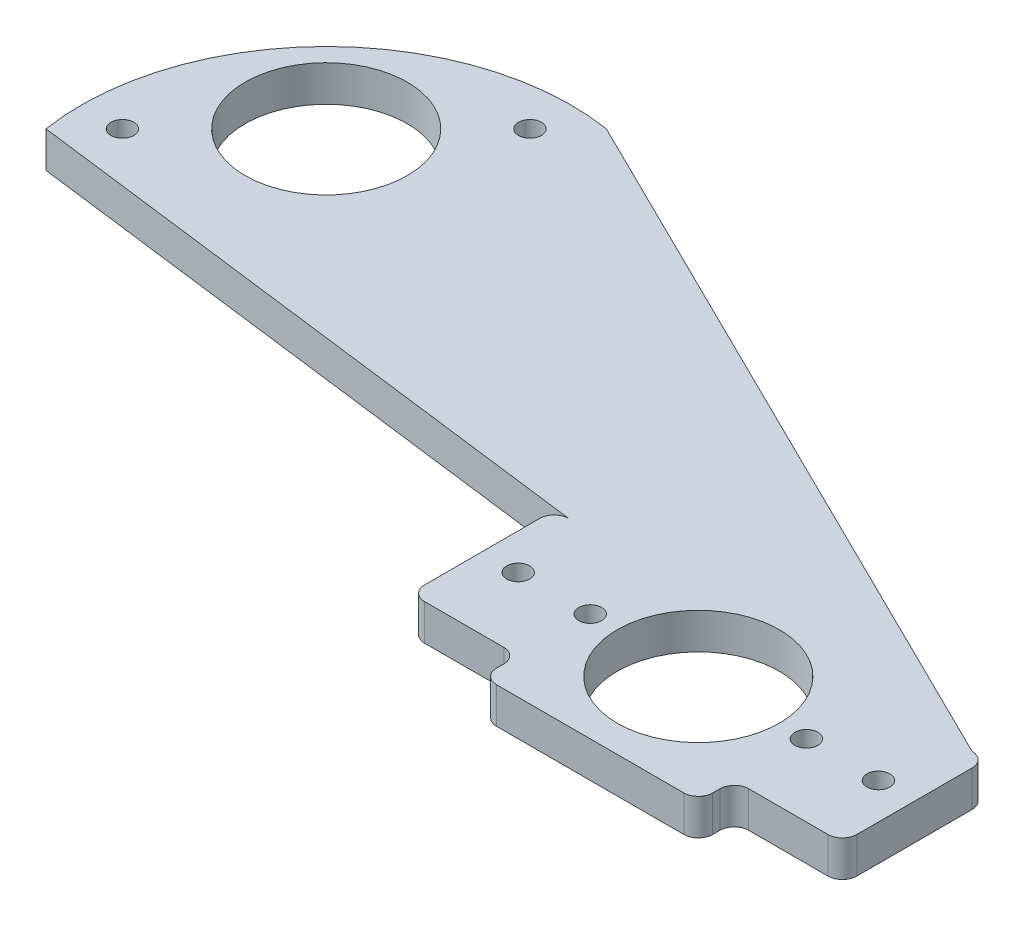
ISO-10303-21;
HEADER;
FILE_DESCRIPTION(('STEP AP214'),'2;1');
FILE_NAME('part.step','',(''),(''),'','','');
FILE_SCHEMA(('AUTOMOTIVE_DESIGN { 1 0 10303 214 1 1 1 1 }'));
ENDSEC;
DATA;
#1=APPLICATION_CONTEXT('core data for automotive mechanical design processes');
#2=APPLICATION_PROTOCOL_DEFINITION('international standard','automotive_design',2000,#1);
#3=PRODUCT_CONTEXT('',#1,'mechanical');
#4=PRODUCT('Part','Part','',(#3));
#5=PRODUCT_RELATED_PRODUCT_CATEGORY('part','',(#4));
#6=PRODUCT_DEFINITION_FORMATION('','',#4);
#7=PRODUCT_DEFINITION_CONTEXT('part definition',#1,'design');
#8=PRODUCT_DEFINITION('design','',#6,#7);
#9=PRODUCT_DEFINITION_SHAPE('','',#8);
#10=(LENGTH_UNIT() NAMED_UNIT(*) SI_UNIT(.MILLI.,.METRE.));
#11=(NAMED_UNIT(*) PLANE_ANGLE_UNIT() SI_UNIT($,.RADIAN.));
#12=(NAMED_UNIT(*) SI_UNIT($,.STERADIAN.) SOLID_ANGLE_UNIT());
#13=UNCERTAINTY_MEASURE_WITH_UNIT(LENGTH_MEASURE(1.E-05),#10,'distance_accuracy_value','');
#14=(GEOMETRIC_REPRESENTATION_CONTEXT(3) GLOBAL_UNCERTAINTY_ASSIGNED_CONTEXT((#13)) GLOBAL_UNIT_ASSIGNED_CONTEXT((#10,
#11,#12)) REPRESENTATION_CONTEXT('',''));
#15=CARTESIAN_POINT('',(0.,0.,0.));
#16=DIRECTION('',(0.,0.,1.));
#17=DIRECTION('',(1.,0.,0.));
#18=AXIS2_PLACEMENT_3D('',#15,#16,#17);
#19=CARTESIAN_POINT('',(-19.05,6.35,0.));
#20=DIRECTION('',(-1.,0.,0.));
#21=DIRECTION('',(0.,0.,1.));
#22=AXIS2_PLACEMENT_3D('',#19,#20,#21);
#23=PLANE('',#22);
#24=DIRECTION('',(0.,0.,-1.));
#25=VECTOR('',#24,1.);
#26=CARTESIAN_POINT('',(-19.05,0.,0.));
#27=LINE('',#26,#25);
#28=CARTESIAN_POINT('',(-19.05,0.,16.51));
#29=VERTEX_POINT('',#28);
#30=CARTESIAN_POINT('',(-19.05,0.,15.24));
#31=VERTEX_POINT('',#30);
#32=EDGE_CURVE('E210',#29,#31,#27,.T.);
#33=ORIENTED_EDGE('',*,*,#32,.F.);
#34=DIRECTION('',(0.,-1.,0.));
#35=VECTOR('',#34,1.);
#36=CARTESIAN_POINT('',(-19.05,6.35,16.51));
#37=LINE('',#36,#35);
#38=CARTESIAN_POINT('',(-19.05,6.35,16.51));
#39=VERTEX_POINT('',#38);
#40=EDGE_CURVE('E11',#39,#29,#37,.T.);
#41=ORIENTED_EDGE('',*,*,#40,.F.);
#42=DIRECTION('',(0.,0.,-1.));
#43=VECTOR('',#42,1.);
#44=CARTESIAN_POINT('',(-19.05,6.35,0.));
#45=LINE('',#44,#43);
#46=CARTESIAN_POINT('',(-19.05,6.35,15.24));
#47=VERTEX_POINT('',#46);
#48=EDGE_CURVE('E429',#39,#47,#45,.T.);
#49=ORIENTED_EDGE('',*,*,#48,.T.);
#50=DIRECTION('',(0.,-1.,0.));
#51=VECTOR('',#50,1.);
#52=CARTESIAN_POINT('',(-19.05,6.35,15.24));
#53=LINE('',#52,#51);
#54=EDGE_CURVE('E59',#47,#31,#53,.T.);
#55=ORIENTED_EDGE('',*,*,#54,.T.);
#56=EDGE_LOOP('',(#33,#41,#49,#55));
#57=FACE_BOUND('',#56,.T.);
#58=ADVANCED_FACE('F41',(#57),#23,.T.);
#59=CARTESIAN_POINT('',(-16.51,6.35,16.51));
#60=DIRECTION('',(0.,-1.,0.));
#61=DIRECTION('',(0.,0.,-1.));
#62=AXIS2_PLACEMENT_3D('',#59,#60,#61);
#63=CYLINDRICAL_SURFACE('',#62,2.54);
#64=CARTESIAN_POINT('',(-16.51,0.,16.51));
#65=DIRECTION('',(0.,1.,0.));
#66=DIRECTION('',(0.,0.,1.));
#67=AXIS2_PLACEMENT_3D('',#64,#65,#66);
#68=CIRCLE('',#67,2.54);
#69=CARTESIAN_POINT('',(-16.51,0.,19.05));
#70=VERTEX_POINT('',#69);
#71=EDGE_CURVE('E213',#29,#70,#68,.T.);
#72=ORIENTED_EDGE('',*,*,#71,.T.);
#73=DIRECTION('',(0.,-1.,0.));
#74=VECTOR('',#73,1.);
#75=CARTESIAN_POINT('',(-16.51,6.35,19.05));
#76=LINE('',#75,#74);
#77=CARTESIAN_POINT('',(-16.51,6.35,19.05));
#78=VERTEX_POINT('',#77);
#79=EDGE_CURVE('E51',#78,#70,#76,.T.);
#80=ORIENTED_EDGE('',*,*,#79,.F.);
#81=CARTESIAN_POINT('',(-16.51,6.35,16.51));
#82=DIRECTION('',(0.,1.,0.));
#83=DIRECTION('',(0.,0.,1.));
#84=AXIS2_PLACEMENT_3D('',#81,#82,#83);
#85=CIRCLE('',#84,2.54);
#86=EDGE_CURVE('E432',#39,#78,#85,.T.);
#87=ORIENTED_EDGE('',*,*,#86,.F.);
#88=ORIENTED_EDGE('',*,*,#40,.T.);
#89=EDGE_LOOP('',(#72,#80,#87,#88));
#90=FACE_BOUND('',#89,.T.);
#91=ADVANCED_FACE('F314',(#90),#63,.T.);
#92=CARTESIAN_POINT('',(0.,6.35,19.05));
#93=DIRECTION('',(0.,0.,-1.));
#94=DIRECTION('',(-1.,0.,0.));
#95=AXIS2_PLACEMENT_3D('',#92,#93,#94);
#96=PLANE('',#95);
#97=DIRECTION('',(1.,0.,0.));
#98=VECTOR('',#97,1.);
#99=CARTESIAN_POINT('',(0.,0.,19.05));
#100=LINE('',#99,#98);
#101=CARTESIAN_POINT('',(16.51,0.,19.05));
#102=VERTEX_POINT('',#101);
#103=EDGE_CURVE('E217',#70,#102,#100,.T.);
#104=ORIENTED_EDGE('',*,*,#103,.T.);
#105=DIRECTION('',(0.,-1.,0.));
#106=VECTOR('',#105,1.);
#107=CARTESIAN_POINT('',(16.51,6.35,19.05));
#108=LINE('',#107,#106);
#109=CARTESIAN_POINT('',(16.51,6.35,19.05));
#110=VERTEX_POINT('',#109);
#111=EDGE_CURVE('E302',#110,#102,#108,.T.);
#112=ORIENTED_EDGE('',*,*,#111,.F.);
#113=DIRECTION('',(1.,0.,0.));
#114=VECTOR('',#113,1.);
#115=CARTESIAN_POINT('',(0.,6.35,19.05));
#116=LINE('',#115,#114);
#117=EDGE_CURVE('E310',#78,#110,#116,.T.);
#118=ORIENTED_EDGE('',*,*,#117,.F.);
#119=ORIENTED_EDGE('',*,*,#79,.T.);
#120=EDGE_LOOP('',(#104,#112,#118,#119));
#121=FACE_BOUND('',#120,.T.);
#122=ADVANCED_FACE('F308',(#121),#96,.F.);
#123=CARTESIAN_POINT('',(16.51,6.35,16.51));
#124=DIRECTION('',(0.,-1.,0.));
#125=DIRECTION('',(0.,0.,-1.));
#126=AXIS2_PLACEMENT_3D('',#123,#124,#125);
#127=CYLINDRICAL_SURFACE('',#126,2.54);
#128=CARTESIAN_POINT('',(16.51,0.,16.51));
#129=DIRECTION('',(0.,1.,0.));
#130=DIRECTION('',(0.,0.,1.));
#131=AXIS2_PLACEMENT_3D('',#128,#129,#130);
#132=CIRCLE('',#131,2.54);
#133=CARTESIAN_POINT('',(19.05,0.,16.51));
#134=VERTEX_POINT('',#133);
#135=EDGE_CURVE('E221',#134,#102,#132,.F.);
#136=ORIENTED_EDGE('',*,*,#135,.F.);
#137=DIRECTION('',(0.,-1.,0.));
#138=VECTOR('',#137,1.);
#139=CARTESIAN_POINT('',(19.05,6.35,16.51));
#140=LINE('',#139,#138);
#141=CARTESIAN_POINT('',(19.05,6.35,16.51));
#142=VERTEX_POINT('',#141);
#143=EDGE_CURVE('E299',#142,#134,#140,.T.);
#144=ORIENTED_EDGE('',*,*,#143,.F.);
#145=CARTESIAN_POINT('',(16.51,6.35,16.51));
#146=DIRECTION('',(0.,1.,0.));
#147=DIRECTION('',(0.,0.,1.));
#148=AXIS2_PLACEMENT_3D('',#145,#146,#147);
#149=CIRCLE('',#148,2.54);
#150=EDGE_CURVE('E437',#142,#110,#149,.F.);
#151=ORIENTED_EDGE('',*,*,#150,.T.);
#152=ORIENTED_EDGE('',*,*,#111,.T.);
#153=EDGE_LOOP('',(#136,#144,#151,#152));
#154=FACE_BOUND('',#153,.T.);
#155=ADVANCED_FACE('F515',(#154),#127,.T.);
#156=CARTESIAN_POINT('',(19.05,6.35,0.));
#157=DIRECTION('',(-1.,0.,0.));
#158=DIRECTION('',(0.,0.,1.));
#159=AXIS2_PLACEMENT_3D('',#156,#157,#158);
#160=PLANE('',#159);
#161=DIRECTION('',(0.,0.,-1.));
#162=VECTOR('',#161,1.);
#163=CARTESIAN_POINT('',(19.05,0.,0.));
#164=LINE('',#163,#162);
#165=CARTESIAN_POINT('',(19.05,0.,15.24));
#166=VERTEX_POINT('',#165);
#167=EDGE_CURVE('E225',#134,#166,#164,.T.);
#168=ORIENTED_EDGE('',*,*,#167,.T.);
#169=DIRECTION('',(0.,-1.,0.));
#170=VECTOR('',#169,1.);
#171=CARTESIAN_POINT('',(19.05,6.35,15.24));
#172=LINE('',#171,#170);
#173=CARTESIAN_POINT('',(19.05,6.35,15.24));
#174=VERTEX_POINT('',#173);
#175=EDGE_CURVE('E296',#174,#166,#172,.T.);
#176=ORIENTED_EDGE('',*,*,#175,.F.);
#177=DIRECTION('',(0.,0.,-1.));
#178=VECTOR('',#177,1.);
#179=CARTESIAN_POINT('',(19.05,6.35,0.));
#180=LINE('',#179,#178);
#181=EDGE_CURVE('E441',#142,#174,#180,.T.);
#182=ORIENTED_EDGE('',*,*,#181,.F.);
#183=ORIENTED_EDGE('',*,*,#143,.T.);
#184=EDGE_LOOP('',(#168,#176,#182,#183));
#185=FACE_BOUND('',#184,.T.);
#186=ADVANCED_FACE('F511',(#185),#160,.F.);
#187=CARTESIAN_POINT('',(21.59,6.35,15.24));
#188=DIRECTION('',(0.,-1.,0.));
#189=DIRECTION('',(0.,0.,-1.));
#190=AXIS2_PLACEMENT_3D('',#187,#188,#189);
#191=CYLINDRICAL_SURFACE('',#190,2.54);
#192=CARTESIAN_POINT('',(21.59,0.,15.24));
#193=DIRECTION('',(0.,1.,0.));
#194=DIRECTION('',(0.,0.,1.));
#195=AXIS2_PLACEMENT_3D('',#192,#193,#194);
#196=CIRCLE('',#195,2.54);
#197=CARTESIAN_POINT('',(21.59,0.,12.7));
#198=VERTEX_POINT('',#197);
#199=EDGE_CURVE('E229',#198,#166,#196,.T.);
#200=ORIENTED_EDGE('',*,*,#199,.F.);
#201=DIRECTION('',(0.,-1.,0.));
#202=VECTOR('',#201,1.);
#203=CARTESIAN_POINT('',(21.59,6.35,12.7));
#204=LINE('',#203,#202);
#205=CARTESIAN_POINT('',(21.59,6.35,12.7));
#206=VERTEX_POINT('',#205);
#207=EDGE_CURVE('E293',#206,#198,#204,.T.);
#208=ORIENTED_EDGE('',*,*,#207,.F.);
#209=CARTESIAN_POINT('',(21.59,6.35,15.24));
#210=DIRECTION('',(0.,1.,0.));
#211=DIRECTION('',(0.,0.,1.));
#212=AXIS2_PLACEMENT_3D('',#209,#210,#211);
#213=CIRCLE('',#212,2.54);
#214=EDGE_CURVE('E444',#206,#174,#213,.T.);
#215=ORIENTED_EDGE('',*,*,#214,.T.);
#216=ORIENTED_EDGE('',*,*,#175,.T.);
#217=EDGE_LOOP('',(#200,#208,#215,#216));
#218=FACE_BOUND('',#217,.T.);
#219=ADVANCED_FACE('F507',(#218),#191,.F.);
#220=CARTESIAN_POINT('',(0.,6.35,12.7));
#221=DIRECTION('',(0.,0.,-1.));
#222=DIRECTION('',(-1.,0.,0.));
#223=AXIS2_PLACEMENT_3D('',#220,#221,#222);
#224=PLANE('',#223);
#225=DIRECTION('',(1.,0.,0.));
#226=VECTOR('',#225,1.);
#227=CARTESIAN_POINT('',(0.,0.,12.7));
#228=LINE('',#227,#226);
#229=CARTESIAN_POINT('',(35.56,0.,12.7));
#230=VERTEX_POINT('',#229);
#231=EDGE_CURVE('E233',#198,#230,#228,.T.);
#232=ORIENTED_EDGE('',*,*,#231,.T.);
#233=DIRECTION('',(0.,-1.,0.));
#234=VECTOR('',#233,1.);
#235=CARTESIAN_POINT('',(35.56,6.35,12.7));
#236=LINE('',#235,#234);
#237=CARTESIAN_POINT('',(35.56,6.35,12.7));
#238=VERTEX_POINT('',#237);
#239=EDGE_CURVE('E290',#238,#230,#236,.T.);
#240=ORIENTED_EDGE('',*,*,#239,.F.);
#241=DIRECTION('',(1.,0.,0.));
#242=VECTOR('',#241,1.);
#243=CARTESIAN_POINT('',(0.,6.35,12.7));
#244=LINE('',#243,#242);
#245=EDGE_CURVE('E448',#206,#238,#244,.T.);
#246=ORIENTED_EDGE('',*,*,#245,.F.);
#247=ORIENTED_EDGE('',*,*,#207,.T.);
#248=EDGE_LOOP('',(#232,#240,#246,#247));
#249=FACE_BOUND('',#248,.T.);
#250=ADVANCED_FACE('F503',(#249),#224,.F.);
#251=CARTESIAN_POINT('',(35.56,6.35,10.16));
#252=DIRECTION('',(0.,-1.,0.));
#253=DIRECTION('',(0.,0.,-1.));
#254=AXIS2_PLACEMENT_3D('',#251,#252,#253);
#255=CYLINDRICAL_SURFACE('',#254,2.54);
#256=CARTESIAN_POINT('',(35.56,0.,10.16));
#257=DIRECTION('',(0.,1.,0.));
#258=DIRECTION('',(0.,0.,1.));
#259=AXIS2_PLACEMENT_3D('',#256,#257,#258);
#260=CIRCLE('',#259,2.54);
#261=CARTESIAN_POINT('',(38.1,0.,10.16));
#262=VERTEX_POINT('',#261);
#263=EDGE_CURVE('E237',#262,#230,#260,.F.);
#264=ORIENTED_EDGE('',*,*,#263,.F.);
#265=DIRECTION('',(0.,-1.,0.));
#266=VECTOR('',#265,1.);
#267=CARTESIAN_POINT('',(38.1,6.35,10.16));
#268=LINE('',#267,#266);
#269=CARTESIAN_POINT('',(38.1,6.35,10.16));
#270=VERTEX_POINT('',#269);
#271=EDGE_CURVE('E287',#270,#262,#268,.T.);
#272=ORIENTED_EDGE('',*,*,#271,.F.);
#273=CARTESIAN_POINT('',(35.56,6.35,10.16));
#274=DIRECTION('',(0.,1.,0.));
#275=DIRECTION('',(0.,0.,1.));
#276=AXIS2_PLACEMENT_3D('',#273,#274,#275);
#277=CIRCLE('',#276,2.54);
#278=EDGE_CURVE('E451',#270,#238,#277,.F.);
#279=ORIENTED_EDGE('',*,*,#278,.T.);
#280=ORIENTED_EDGE('',*,*,#239,.T.);
#281=EDGE_LOOP('',(#264,#272,#279,#280));
#282=FACE_BOUND('',#281,.T.);
#283=ADVANCED_FACE('F499',(#282),#255,.T.);
#284=CARTESIAN_POINT('',(38.1,6.35,0.));
#285=DIRECTION('',(1.,0.,0.));
#286=DIRECTION('',(0.,0.,-1.));
#287=AXIS2_PLACEMENT_3D('',#284,#285,#286);
#288=PLANE('',#287);
#289=DIRECTION('',(0.,0.,1.));
#290=VECTOR('',#289,1.);
#291=CARTESIAN_POINT('',(38.1,0.,0.));
#292=LINE('',#291,#290);
#293=CARTESIAN_POINT('',(38.1,0.,-10.16));
#294=VERTEX_POINT('',#293);
#295=EDGE_CURVE('E241',#294,#262,#292,.T.);
#296=ORIENTED_EDGE('',*,*,#295,.F.);
#297=DIRECTION('',(0.,-1.,0.));
#298=VECTOR('',#297,1.);
#299=CARTESIAN_POINT('',(38.1,6.35,-10.16));
#300=LINE('',#299,#298);
#301=CARTESIAN_POINT('',(38.1,6.35,-10.16));
#302=VERTEX_POINT('',#301);
#303=EDGE_CURVE('E284',#302,#294,#300,.T.);
#304=ORIENTED_EDGE('',*,*,#303,.F.);
#305=DIRECTION('',(0.,0.,1.));
#306=VECTOR('',#305,1.);
#307=CARTESIAN_POINT('',(38.1,6.35,0.));
#308=LINE('',#307,#306);
#309=EDGE_CURVE('E455',#302,#270,#308,.T.);
#310=ORIENTED_EDGE('',*,*,#309,.T.);
#311=ORIENTED_EDGE('',*,*,#271,.T.);
#312=EDGE_LOOP('',(#296,#304,#310,#311));
#313=FACE_BOUND('',#312,.T.);
#314=ADVANCED_FACE('F495',(#313),#288,.T.);
#315=CARTESIAN_POINT('',(35.56,6.35,-10.16));
#316=DIRECTION('',(0.,-1.,0.));
#317=DIRECTION('',(0.,0.,-1.));
#318=AXIS2_PLACEMENT_3D('',#315,#316,#317);
#319=CYLINDRICAL_SURFACE('',#318,2.54);
#320=CARTESIAN_POINT('',(35.56,0.,-10.16));
#321=DIRECTION('',(0.,1.,0.));
#322=DIRECTION('',(0.,0.,1.));
#323=AXIS2_PLACEMENT_3D('',#320,#321,#322);
#324=CIRCLE('',#323,2.54);
#325=CARTESIAN_POINT('',(35.56,0.,-12.7));
#326=VERTEX_POINT('',#325);
#327=EDGE_CURVE('E245',#294,#326,#324,.T.);
#328=ORIENTED_EDGE('',*,*,#327,.T.);
#329=DIRECTION('',(0.,-1.,0.));
#330=VECTOR('',#329,1.);
#331=CARTESIAN_POINT('',(35.56,6.35,-12.7));
#332=LINE('',#331,#330);
#333=CARTESIAN_POINT('',(35.56,6.35,-12.7));
#334=VERTEX_POINT('',#333);
#335=EDGE_CURVE('E280',#334,#326,#332,.T.);
#336=ORIENTED_EDGE('',*,*,#335,.F.);
#337=CARTESIAN_POINT('',(35.56,6.35,-10.16));
#338=DIRECTION('',(0.,1.,0.));
#339=DIRECTION('',(0.,0.,1.));
#340=AXIS2_PLACEMENT_3D('',#337,#338,#339);
#341=CIRCLE('',#340,2.54);
#342=EDGE_CURVE('E459',#302,#334,#341,.T.);
#343=ORIENTED_EDGE('',*,*,#342,.F.);
#344=ORIENTED_EDGE('',*,*,#303,.T.);
#345=EDGE_LOOP('',(#328,#336,#343,#344));
#346=FACE_BOUND('',#345,.T.);
#347=ADVANCED_FACE('F492',(#346),#319,.T.);
#348=CARTESIAN_POINT('',(-35.56,6.35,-10.16));
#349=DIRECTION('',(0.,-1.,0.));
#350=DIRECTION('',(0.,0.,-1.));
#351=AXIS2_PLACEMENT_3D('',#348,#349,#350);
#352=CYLINDRICAL_SURFACE('',#351,2.54);
#353=CARTESIAN_POINT('',(-35.56,0.,-10.16));
#354=DIRECTION('',(0.,1.,0.));
#355=DIRECTION('',(0.,0.,1.));
#356=AXIS2_PLACEMENT_3D('',#353,#354,#355);
#357=CIRCLE('',#356,2.54);
#358=CARTESIAN_POINT('',(-35.56,0.,-12.7));
#359=VERTEX_POINT('',#358);
#360=CARTESIAN_POINT('',(-38.1,0.,-10.16));
#361=VERTEX_POINT('',#360);
#362=EDGE_CURVE('E248',#359,#361,#357,.T.);
#363=ORIENTED_EDGE('',*,*,#362,.T.);
#364=DIRECTION('',(0.,-1.,0.));
#365=VECTOR('',#364,1.);
#366=CARTESIAN_POINT('',(-38.1,6.35,-10.16));
#367=LINE('',#366,#365);
#368=CARTESIAN_POINT('',(-38.1,6.35,-10.16));
#369=VERTEX_POINT('',#368);
#370=EDGE_CURVE('E272',#369,#361,#367,.T.);
#371=ORIENTED_EDGE('',*,*,#370,.F.);
#372=CARTESIAN_POINT('',(-35.56,6.35,-10.16));
#373=DIRECTION('',(0.,1.,0.));
#374=DIRECTION('',(0.,0.,1.));
#375=AXIS2_PLACEMENT_3D('',#372,#373,#374);
#376=CIRCLE('',#375,2.54);
#377=CARTESIAN_POINT('',(-35.56,6.35,-12.7));
#378=VERTEX_POINT('',#377);
#379=EDGE_CURVE('E462',#378,#369,#376,.T.);
#380=ORIENTED_EDGE('',*,*,#379,.F.);
#381=DIRECTION('',(0.,-1.,0.));
#382=VECTOR('',#381,1.);
#383=CARTESIAN_POINT('',(-35.56,6.35,-12.7));
#384=LINE('',#383,#382);
#385=EDGE_CURVE('E276',#378,#359,#384,.T.);
#386=ORIENTED_EDGE('',*,*,#385,.T.);
#387=EDGE_LOOP('',(#363,#371,#380,#386));
#388=FACE_BOUND('',#387,.T.);
#389=ADVANCED_FACE('F470',(#388),#352,.T.);
#390=CARTESIAN_POINT('',(-38.1,6.35,0.));
#391=DIRECTION('',(1.,0.,0.));
#392=DIRECTION('',(0.,0.,-1.));
#393=AXIS2_PLACEMENT_3D('',#390,#391,#392);
#394=PLANE('',#393);
#395=DIRECTION('',(0.,0.,1.));
#396=VECTOR('',#395,1.);
#397=CARTESIAN_POINT('',(-38.1,0.,0.));
#398=LINE('',#397,#396);
#399=CARTESIAN_POINT('',(-38.1,0.,10.16));
#400=VERTEX_POINT('',#399);
#401=EDGE_CURVE('E252',#361,#400,#398,.T.);
#402=ORIENTED_EDGE('',*,*,#401,.T.);
#403=DIRECTION('',(0.,-1.,0.));
#404=VECTOR('',#403,1.);
#405=CARTESIAN_POINT('',(-38.1,6.35,10.16));
#406=LINE('',#405,#404);
#407=CARTESIAN_POINT('',(-38.1,6.35,10.16));
#408=VERTEX_POINT('',#407);
#409=EDGE_CURVE('E179',#408,#400,#406,.T.);
#410=ORIENTED_EDGE('',*,*,#409,.F.);
#411=DIRECTION('',(0.,0.,1.));
#412=VECTOR('',#411,1.);
#413=CARTESIAN_POINT('',(-38.1,6.35,0.));
#414=LINE('',#413,#412);
#415=EDGE_CURVE('E166',#369,#408,#414,.T.);
#416=ORIENTED_EDGE('',*,*,#415,.F.);
#417=ORIENTED_EDGE('',*,*,#370,.T.);
#418=EDGE_LOOP('',(#402,#410,#416,#417));
#419=FACE_BOUND('',#418,.T.);
#420=ADVANCED_FACE('F473',(#419),#394,.F.);
#421=CARTESIAN_POINT('',(-35.56,6.35,10.16));
#422=DIRECTION('',(0.,-1.,0.));
#423=DIRECTION('',(0.,0.,-1.));
#424=AXIS2_PLACEMENT_3D('',#421,#422,#423);
#425=CYLINDRICAL_SURFACE('',#424,2.54);
#426=CARTESIAN_POINT('',(-35.56,0.,10.16));
#427=DIRECTION('',(0.,1.,0.));
#428=DIRECTION('',(0.,0.,1.));
#429=AXIS2_PLACEMENT_3D('',#426,#427,#428);
#430=CIRCLE('',#429,2.54);
#431=CARTESIAN_POINT('',(-35.56,0.,12.7));
#432=VERTEX_POINT('',#431);
#433=EDGE_CURVE('E175',#400,#432,#430,.T.);
#434=ORIENTED_EDGE('',*,*,#433,.T.);
#435=DIRECTION('',(0.,-1.,0.));
#436=VECTOR('',#435,1.);
#437=CARTESIAN_POINT('',(-35.56,6.35,12.7));
#438=LINE('',#437,#436);
#439=CARTESIAN_POINT('',(-35.56,6.35,12.7));
#440=VERTEX_POINT('',#439);
#441=EDGE_CURVE('E173',#440,#432,#438,.T.);
#442=ORIENTED_EDGE('',*,*,#441,.F.);
#443=CARTESIAN_POINT('',(-35.56,6.35,10.16));
#444=DIRECTION('',(0.,1.,0.));
#445=DIRECTION('',(0.,0.,1.));
#446=AXIS2_PLACEMENT_3D('',#443,#444,#445);
#447=CIRCLE('',#446,2.54);
#448=EDGE_CURVE('E158',#408,#440,#447,.T.);
#449=ORIENTED_EDGE('',*,*,#448,.F.);
#450=ORIENTED_EDGE('',*,*,#409,.T.);
#451=EDGE_LOOP('',(#434,#442,#449,#450));
#452=FACE_BOUND('',#451,.T.);
#453=ADVANCED_FACE('F174',(#452),#425,.T.);
#454=CARTESIAN_POINT('',(0.,6.35,12.7));
#455=DIRECTION('',(0.,0.,1.));
#456=DIRECTION('',(1.,0.,0.));
#457=AXIS2_PLACEMENT_3D('',#454,#455,#456);
#458=PLANE('',#457);
#459=DIRECTION('',(-1.,0.,0.));
#460=VECTOR('',#459,1.);
#461=CARTESIAN_POINT('',(0.,0.,12.7));
#462=LINE('',#461,#460);
#463=CARTESIAN_POINT('',(-21.59,0.,12.7));
#464=VERTEX_POINT('',#463);
#465=EDGE_CURVE('E258',#464,#432,#462,.T.);
#466=ORIENTED_EDGE('',*,*,#465,.F.);
#467=DIRECTION('',(0.,-1.,0.));
#468=VECTOR('',#467,1.);
#469=CARTESIAN_POINT('',(-21.59,6.35,12.7));
#470=LINE('',#469,#468);
#471=CARTESIAN_POINT('',(-21.59,6.35,12.7));
#472=VERTEX_POINT('',#471);
#473=EDGE_CURVE('E106',#472,#464,#470,.T.);
#474=ORIENTED_EDGE('',*,*,#473,.F.);
#475=DIRECTION('',(-1.,0.,0.));
#476=VECTOR('',#475,1.);
#477=CARTESIAN_POINT('',(0.,6.35,12.7));
#478=LINE('',#477,#476);
#479=EDGE_CURVE('E164',#472,#440,#478,.T.);
#480=ORIENTED_EDGE('',*,*,#479,.T.);
#481=ORIENTED_EDGE('',*,*,#441,.T.);
#482=EDGE_LOOP('',(#466,#474,#480,#481));
#483=FACE_BOUND('',#482,.T.);
#484=ADVANCED_FACE('F181',(#483),#458,.T.);
#485=CARTESIAN_POINT('',(31.75,6.35,0.));
#486=DIRECTION('',(0.,-1.,0.));
#487=DIRECTION('',(0.,0.,-1.));
#488=AXIS2_PLACEMENT_3D('',#485,#486,#487);
#489=CYLINDRICAL_SURFACE('',#488,2.0193);
#490=CARTESIAN_POINT('',(31.75,6.35,0.));
#491=DIRECTION('',(0.,1.,0.));
#492=DIRECTION('',(0.,0.,1.));
#493=AXIS2_PLACEMENT_3D('',#490,#491,#492);
#494=CIRCLE('',#493,2.0193);
#495=CARTESIAN_POINT('',(31.75,6.35,2.0193));
#496=VERTEX_POINT('',#495);
#497=EDGE_CURVE('E425',#496,#496,#494,.F.);
#498=ORIENTED_EDGE('',*,*,#497,.F.);
#499=EDGE_LOOP('',(#498));
#500=FACE_BOUND('',#499,.T.);
#501=CARTESIAN_POINT('',(31.75,0.,0.));
#502=DIRECTION('',(0.,1.,0.));
#503=DIRECTION('',(0.,0.,1.));
#504=AXIS2_PLACEMENT_3D('',#501,#502,#503);
#505=CIRCLE('',#504,2.0193);
#506=CARTESIAN_POINT('',(31.75,0.,2.0193));
#507=VERTEX_POINT('',#506);
#508=EDGE_CURVE('E206',#507,#507,#505,.F.);
#509=ORIENTED_EDGE('',*,*,#508,.T.);
#510=EDGE_LOOP('',(#509));
#511=FACE_BOUND('',#510,.T.);
#512=ADVANCED_FACE('F327',(#500,#511),#489,.F.);
#513=CARTESIAN_POINT('',(0.,6.35,0.));
#514=DIRECTION('',(0.,-1.,0.));
#515=DIRECTION('',(0.,0.,-1.));
#516=AXIS2_PLACEMENT_3D('',#513,#514,#515);
#517=CYLINDRICAL_SURFACE('',#516,14.2875);
#518=CARTESIAN_POINT('',(0.,6.35,0.));
#519=DIRECTION('',(0.,1.,0.));
#520=DIRECTION('',(0.,0.,1.));
#521=AXIS2_PLACEMENT_3D('',#518,#519,#520);
#522=CIRCLE('',#521,14.2875);
#523=CARTESIAN_POINT('',(0.,6.35,14.2875));
#524=VERTEX_POINT('',#523);
#525=EDGE_CURVE('E421',#524,#524,#522,.T.);
#526=ORIENTED_EDGE('',*,*,#525,.T.);
#527=EDGE_LOOP('',(#526));
#528=FACE_BOUND('',#527,.T.);
#529=CARTESIAN_POINT('',(0.,0.,0.));
#530=DIRECTION('',(0.,1.,0.));
#531=DIRECTION('',(0.,0.,1.));
#532=AXIS2_PLACEMENT_3D('',#529,#530,#531);
#533=CIRCLE('',#532,14.2875);
#534=CARTESIAN_POINT('',(0.,0.,14.2875));
#535=VERTEX_POINT('',#534);
#536=EDGE_CURVE('E202',#535,#535,#533,.T.);
#537=ORIENTED_EDGE('',*,*,#536,.F.);
#538=EDGE_LOOP('',(#537));
#539=FACE_BOUND('',#538,.T.);
#540=ADVANCED_FACE('F330',(#528,#539),#517,.F.);
#541=CARTESIAN_POINT('',(-31.75,6.35,0.));
#542=DIRECTION('',(0.,-1.,0.));
#543=DIRECTION('',(0.,0.,-1.));
#544=AXIS2_PLACEMENT_3D('',#541,#542,#543);
#545=CYLINDRICAL_SURFACE('',#544,2.0193);
#546=CARTESIAN_POINT('',(-31.75,6.35,0.));
#547=DIRECTION('',(0.,1.,0.));
#548=DIRECTION('',(0.,0.,1.));
#549=AXIS2_PLACEMENT_3D('',#546,#547,#548);
#550=CIRCLE('',#549,2.0193);
#551=CARTESIAN_POINT('',(-31.75,6.35,2.0193));
#552=VERTEX_POINT('',#551);
#553=EDGE_CURVE('E417',#552,#552,#550,.T.);
#554=ORIENTED_EDGE('',*,*,#553,.T.);
#555=EDGE_LOOP('',(#554));
#556=FACE_BOUND('',#555,.T.);
#557=CARTESIAN_POINT('',(-31.75,0.,0.));
#558=DIRECTION('',(0.,1.,0.));
#559=DIRECTION('',(0.,0.,1.));
#560=AXIS2_PLACEMENT_3D('',#557,#558,#559);
#561=CIRCLE('',#560,2.0193);
#562=CARTESIAN_POINT('',(-31.75,0.,2.0193));
#563=VERTEX_POINT('',#562);
#564=EDGE_CURVE('E198',#563,#563,#561,.T.);
#565=ORIENTED_EDGE('',*,*,#564,.F.);
#566=EDGE_LOOP('',(#565));
#567=FACE_BOUND('',#566,.T.);
#568=ADVANCED_FACE('F334',(#556,#567),#545,.F.);
#569=CARTESIAN_POINT('',(-19.05,6.35,0.));
#570=DIRECTION('',(0.,-1.,0.));
#571=DIRECTION('',(0.,0.,-1.));
#572=AXIS2_PLACEMENT_3D('',#569,#570,#571);
#573=CYLINDRICAL_SURFACE('',#572,2.0193);
#574=CARTESIAN_POINT('',(-19.05,6.35,0.));
#575=DIRECTION('',(0.,1.,0.));
#576=DIRECTION('',(0.,0.,1.));
#577=AXIS2_PLACEMENT_3D('',#574,#575,#576);
#578=CIRCLE('',#577,2.0193);
#579=CARTESIAN_POINT('',(-19.05,6.35,2.0193));
#580=VERTEX_POINT('',#579);
#581=EDGE_CURVE('E349',#580,#580,#578,.T.);
#582=ORIENTED_EDGE('',*,*,#581,.T.);
#583=EDGE_LOOP('',(#582));
#584=FACE_BOUND('',#583,.T.);
#585=CARTESIAN_POINT('',(-19.05,0.,0.));
#586=DIRECTION('',(0.,1.,0.));
#587=DIRECTION('',(0.,0.,1.));
#588=AXIS2_PLACEMENT_3D('',#585,#586,#587);
#589=CIRCLE('',#588,2.0193);
#590=CARTESIAN_POINT('',(-19.05,0.,2.0193));
#591=VERTEX_POINT('',#590);
#592=EDGE_CURVE('E193',#591,#591,#589,.T.);
#593=ORIENTED_EDGE('',*,*,#592,.F.);
#594=EDGE_LOOP('',(#593));
#595=FACE_BOUND('',#594,.T.);
#596=ADVANCED_FACE('F337',(#584,#595),#573,.F.);
#597=CARTESIAN_POINT('',(19.05,6.35,0.));
#598=DIRECTION('',(0.,-1.,0.));
#599=DIRECTION('',(0.,0.,-1.));
#600=AXIS2_PLACEMENT_3D('',#597,#598,#599);
#601=CYLINDRICAL_SURFACE('',#600,2.0193);
#602=CARTESIAN_POINT('',(19.05,6.35,0.));
#603=DIRECTION('',(0.,1.,0.));
#604=DIRECTION('',(0.,0.,1.));
#605=AXIS2_PLACEMENT_3D('',#602,#603,#604);
#606=CIRCLE('',#605,2.0193);
#607=CARTESIAN_POINT('',(19.05,6.35,2.0193));
#608=VERTEX_POINT('',#607);
#609=EDGE_CURVE('E265',#608,#608,#606,.F.);
#610=ORIENTED_EDGE('',*,*,#609,.F.);
#611=EDGE_LOOP('',(#610));
#612=FACE_BOUND('',#611,.T.);
#613=CARTESIAN_POINT('',(19.05,0.,0.));
#614=DIRECTION('',(0.,1.,0.));
#615=DIRECTION('',(0.,0.,1.));
#616=AXIS2_PLACEMENT_3D('',#613,#614,#615);
#617=CIRCLE('',#616,2.0193);
#618=CARTESIAN_POINT('',(19.05,0.,2.0193));
#619=VERTEX_POINT('',#618);
#620=EDGE_CURVE('E189',#619,#619,#617,.F.);
#621=ORIENTED_EDGE('',*,*,#620,.T.);
#622=EDGE_LOOP('',(#621));
#623=FACE_BOUND('',#622,.T.);
#624=ADVANCED_FACE('F43',(#612,#623),#601,.F.);
#625=CARTESIAN_POINT('',(-21.59,6.35,15.24));
#626=DIRECTION('',(0.,-1.,0.));
#627=DIRECTION('',(0.,0.,-1.));
#628=AXIS2_PLACEMENT_3D('',#625,#626,#627);
#629=CYLINDRICAL_SURFACE('',#628,2.54);
#630=CARTESIAN_POINT('',(-21.59,0.,15.24));
#631=DIRECTION('',(0.,1.,0.));
#632=DIRECTION('',(0.,0.,1.));
#633=AXIS2_PLACEMENT_3D('',#630,#631,#632);
#634=CIRCLE('',#633,2.54);
#635=EDGE_CURVE('E261',#31,#464,#634,.T.);
#636=ORIENTED_EDGE('',*,*,#635,.F.);
#637=ORIENTED_EDGE('',*,*,#54,.F.);
#638=CARTESIAN_POINT('',(-21.59,6.35,15.24));
#639=DIRECTION('',(0.,1.,0.));
#640=DIRECTION('',(0.,0.,1.));
#641=AXIS2_PLACEMENT_3D('',#638,#639,#640);
#642=CIRCLE('',#641,2.54);
#643=EDGE_CURVE('E183',#47,#472,#642,.T.);
#644=ORIENTED_EDGE('',*,*,#643,.T.);
#645=ORIENTED_EDGE('',*,*,#473,.T.);
#646=EDGE_LOOP('',(#636,#637,#644,#645));
#647=FACE_BOUND('',#646,.T.);
#648=ADVANCED_FACE('F344',(#647),#629,.F.);
#649=CARTESIAN_POINT('',(0.,6.35,0.));
#650=DIRECTION('',(0.,1.,0.));
#651=DIRECTION('',(0.,0.,1.));
#652=AXIS2_PLACEMENT_3D('',#649,#650,#651);
#653=PLANE('',#652);
#654=ORIENTED_EDGE('',*,*,#342,.T.);
#655=DIRECTION('',(0.89676881755224,0.,0.442499364819835));
#656=VECTOR('',#655,1.);
#657=CARTESIAN_POINT('',(12.0024595889086,6.35,-24.3241738836088));
#658=LINE('',#657,#656);
#659=CARTESIAN_POINT('',(-91.7017183189382,6.35,-75.4957043329402));
#660=VERTEX_POINT('',#659);
#661=EDGE_CURVE('E392',#660,#334,#658,.T.);
#662=ORIENTED_EDGE('',*,*,#661,.F.);
#663=CARTESIAN_POINT('',(-98.43691040974,6.35,-32.8394877578617));
#664=DIRECTION('',(0.,1.,0.));
#665=DIRECTION('',(0.,0.,1.));
#666=AXIS2_PLACEMENT_3D('',#663,#664,#665);
#667=CIRCLE('',#666,43.184668865235);
#668=CARTESIAN_POINT('',(-141.093126984818,6.35,-26.1042956670598));
#669=VERTEX_POINT('',#668);
#670=EDGE_CURVE('E384',#669,#660,#667,.F.);
#671=ORIENTED_EDGE('',*,*,#670,.F.);
#672=DIRECTION('',(0.992029894829151,0.,0.126002729197677));
#673=VECTOR('',#672,1.);
#674=CARTESIAN_POINT('',(1.02290560533305,6.35,-8.05342032303691));
#675=LINE('',#674,#673);
#676=EDGE_CURVE('E388',#669,#378,#675,.T.);
#677=ORIENTED_EDGE('',*,*,#676,.T.);
#678=ORIENTED_EDGE('',*,*,#379,.T.);
#679=ORIENTED_EDGE('',*,*,#415,.T.);
#680=ORIENTED_EDGE('',*,*,#448,.T.);
#681=ORIENTED_EDGE('',*,*,#479,.F.);
#682=ORIENTED_EDGE('',*,*,#643,.F.);
#683=ORIENTED_EDGE('',*,*,#48,.F.);
#684=ORIENTED_EDGE('',*,*,#86,.T.);
#685=ORIENTED_EDGE('',*,*,#117,.T.);
#686=ORIENTED_EDGE('',*,*,#150,.F.);
#687=ORIENTED_EDGE('',*,*,#181,.T.);
#688=ORIENTED_EDGE('',*,*,#214,.F.);
#689=ORIENTED_EDGE('',*,*,#245,.T.);
#690=ORIENTED_EDGE('',*,*,#278,.F.);
#691=ORIENTED_EDGE('',*,*,#309,.F.);
#692=EDGE_LOOP('',(#654,#662,#671,#677,#678,#679,#680,#681,#682,#683,#684,#685,#686,#687,#688,
#689,#690,#691));
#693=FACE_BOUND('',#692,.T.);
#694=ORIENTED_EDGE('',*,*,#609,.T.);
#695=EDGE_LOOP('',(#694));
#696=FACE_BOUND('',#695,.T.);
#697=ORIENTED_EDGE('',*,*,#581,.F.);
#698=EDGE_LOOP('',(#697));
#699=FACE_BOUND('',#698,.T.);
#700=ORIENTED_EDGE('',*,*,#553,.F.);
#701=EDGE_LOOP('',(#700));
#702=FACE_BOUND('',#701,.T.);
#703=ORIENTED_EDGE('',*,*,#525,.F.);
#704=EDGE_LOOP('',(#703));
#705=FACE_BOUND('',#704,.T.);
#706=ORIENTED_EDGE('',*,*,#497,.T.);
#707=EDGE_LOOP('',(#706));
#708=FACE_BOUND('',#707,.T.);
#709=CARTESIAN_POINT('',(-98.4369104097401,6.35,-68.7605122421383));
#710=DIRECTION('',(0.,1.,0.));
#711=DIRECTION('',(0.,0.,1.));
#712=AXIS2_PLACEMENT_3D('',#709,#710,#711);
#713=CIRCLE('',#712,2.01930000000002);
#714=CARTESIAN_POINT('',(-98.4369104097401,6.35,-66.7412122421383));
#715=VERTEX_POINT('',#714);
#716=EDGE_CURVE('E396',#715,#715,#713,.T.);
#717=ORIENTED_EDGE('',*,*,#716,.F.);
#718=EDGE_LOOP('',(#717));
#719=FACE_BOUND('',#718,.T.);
#720=CARTESIAN_POINT('',(-134.357934894017,6.35,-32.8394877578617));
#721=DIRECTION('',(0.,1.,0.));
#722=DIRECTION('',(0.,0.,1.));
#723=AXIS2_PLACEMENT_3D('',#720,#721,#722);
#724=CIRCLE('',#723,2.01930000000001);
#725=CARTESIAN_POINT('',(-134.357934894017,6.35,-30.8201877578617));
#726=VERTEX_POINT('',#725);
#727=EDGE_CURVE('E400',#726,#726,#724,.T.);
#728=ORIENTED_EDGE('',*,*,#727,.F.);
#729=EDGE_LOOP('',(#728));
#730=FACE_BOUND('',#729,.T.);
#731=CARTESIAN_POINT('',(-116.397422651878,6.35,-50.8));
#732=DIRECTION('',(0.,1.,0.));
#733=DIRECTION('',(0.,0.,1.));
#734=AXIS2_PLACEMENT_3D('',#731,#732,#733);
#735=CIRCLE('',#734,14.2875);
#736=CARTESIAN_POINT('',(-116.397422651878,6.35,-36.5125));
#737=VERTEX_POINT('',#736);
#738=EDGE_CURVE('E404',#737,#737,#735,.T.);
#739=ORIENTED_EDGE('',*,*,#738,.F.);
#740=EDGE_LOOP('',(#739));
#741=FACE_BOUND('',#740,.T.);
#742=ADVANCED_FACE('F160',(#693,#696,#699,#702,#705,#708,#719,#730,#741),#653,.T.);
#743=CARTESIAN_POINT('',(0.,0.,0.));
#744=DIRECTION('',(0.,1.,0.));
#745=DIRECTION('',(0.,0.,1.));
#746=AXIS2_PLACEMENT_3D('',#743,#744,#745);
#747=PLANE('',#746);
#748=DIRECTION('',(0.89676881755224,0.,0.442499364819835));
#749=VECTOR('',#748,1.);
#750=CARTESIAN_POINT('',(12.0024595889086,0.,-24.3241738836088));
#751=LINE('',#750,#749);
#752=CARTESIAN_POINT('',(-91.7017183189382,0.,-75.4957043329402));
#753=VERTEX_POINT('',#752);
#754=EDGE_CURVE('E710',#753,#326,#751,.T.);
#755=ORIENTED_EDGE('',*,*,#754,.T.);
#756=ORIENTED_EDGE('',*,*,#327,.F.);
#757=ORIENTED_EDGE('',*,*,#295,.T.);
#758=ORIENTED_EDGE('',*,*,#263,.T.);
#759=ORIENTED_EDGE('',*,*,#231,.F.);
#760=ORIENTED_EDGE('',*,*,#199,.T.);
#761=ORIENTED_EDGE('',*,*,#167,.F.);
#762=ORIENTED_EDGE('',*,*,#135,.T.);
#763=ORIENTED_EDGE('',*,*,#103,.F.);
#764=ORIENTED_EDGE('',*,*,#71,.F.);
#765=ORIENTED_EDGE('',*,*,#32,.T.);
#766=ORIENTED_EDGE('',*,*,#635,.T.);
#767=ORIENTED_EDGE('',*,*,#465,.T.);
#768=ORIENTED_EDGE('',*,*,#433,.F.);
#769=ORIENTED_EDGE('',*,*,#401,.F.);
#770=ORIENTED_EDGE('',*,*,#362,.F.);
#771=DIRECTION('',(0.992029894829151,0.,0.126002729197677));
#772=VECTOR('',#771,1.);
#773=CARTESIAN_POINT('',(1.02290560533305,0.,-8.05342032303691));
#774=LINE('',#773,#772);
#775=CARTESIAN_POINT('',(-141.093126984818,0.,-26.1042956670598));
#776=VERTEX_POINT('',#775);
#777=EDGE_CURVE('E716',#776,#359,#774,.T.);
#778=ORIENTED_EDGE('',*,*,#777,.F.);
#779=CARTESIAN_POINT('',(-98.43691040974,0.,-32.8394877578617));
#780=DIRECTION('',(0.,1.,0.));
#781=DIRECTION('',(0.,0.,1.));
#782=AXIS2_PLACEMENT_3D('',#779,#780,#781);
#783=CIRCLE('',#782,43.184668865235);
#784=EDGE_CURVE('E408',#776,#753,#783,.F.);
#785=ORIENTED_EDGE('',*,*,#784,.T.);
#786=EDGE_LOOP('',(#755,#756,#757,#758,#759,#760,#761,#762,#763,#764,#765,#766,#767,#768,#769,
#770,#778,#785));
#787=FACE_BOUND('',#786,.T.);
#788=ORIENTED_EDGE('',*,*,#620,.F.);
#789=EDGE_LOOP('',(#788));
#790=FACE_BOUND('',#789,.T.);
#791=ORIENTED_EDGE('',*,*,#592,.T.);
#792=EDGE_LOOP('',(#791));
#793=FACE_BOUND('',#792,.T.);
#794=ORIENTED_EDGE('',*,*,#564,.T.);
#795=EDGE_LOOP('',(#794));
#796=FACE_BOUND('',#795,.T.);
#797=ORIENTED_EDGE('',*,*,#536,.T.);
#798=EDGE_LOOP('',(#797));
#799=FACE_BOUND('',#798,.T.);
#800=ORIENTED_EDGE('',*,*,#508,.F.);
#801=EDGE_LOOP('',(#800));
#802=FACE_BOUND('',#801,.T.);
#803=CARTESIAN_POINT('',(-98.4369104097401,0.,-68.7605122421383));
#804=DIRECTION('',(0.,1.,0.));
#805=DIRECTION('',(0.,0.,1.));
#806=AXIS2_PLACEMENT_3D('',#803,#804,#805);
#807=CIRCLE('',#806,2.01930000000002);
#808=CARTESIAN_POINT('',(-98.4369104097401,0.,-66.7412122421383));
#809=VERTEX_POINT('',#808);
#810=EDGE_CURVE('E365',#809,#809,#807,.T.);
#811=ORIENTED_EDGE('',*,*,#810,.T.);
#812=EDGE_LOOP('',(#811));
#813=FACE_BOUND('',#812,.T.);
#814=CARTESIAN_POINT('',(-134.357934894017,0.,-32.8394877578617));
#815=DIRECTION('',(0.,1.,0.));
#816=DIRECTION('',(0.,0.,1.));
#817=AXIS2_PLACEMENT_3D('',#814,#815,#816);
#818=CIRCLE('',#817,2.01930000000001);
#819=CARTESIAN_POINT('',(-134.357934894017,0.,-30.8201877578617));
#820=VERTEX_POINT('',#819);
#821=EDGE_CURVE('E369',#820,#820,#818,.T.);
#822=ORIENTED_EDGE('',*,*,#821,.T.);
#823=EDGE_LOOP('',(#822));
#824=FACE_BOUND('',#823,.T.);
#825=CARTESIAN_POINT('',(-116.397422651878,0.,-50.8));
#826=DIRECTION('',(0.,1.,0.));
#827=DIRECTION('',(0.,0.,1.));
#828=AXIS2_PLACEMENT_3D('',#825,#826,#827);
#829=CIRCLE('',#828,14.2875);
#830=CARTESIAN_POINT('',(-116.397422651878,0.,-36.5125));
#831=VERTEX_POINT('',#830);
#832=EDGE_CURVE('E372',#831,#831,#829,.T.);
#833=ORIENTED_EDGE('',*,*,#832,.T.);
#834=EDGE_LOOP('',(#833));
#835=FACE_BOUND('',#834,.T.);
#836=ADVANCED_FACE('F317',(#787,#790,#793,#796,#799,#802,#813,#824,#835),#747,.F.);
#837=CARTESIAN_POINT('',(-98.43691040974,0.,-32.8394877578617));
#838=DIRECTION('',(0.,1.,0.));
#839=DIRECTION('',(0.,0.,1.));
#840=AXIS2_PLACEMENT_3D('',#837,#838,#839);
#841=CYLINDRICAL_SURFACE('',#840,43.184668865235);
#842=ORIENTED_EDGE('',*,*,#670,.T.);
#843=DIRECTION('',(0.,1.,0.));
#844=VECTOR('',#843,1.);
#845=CARTESIAN_POINT('',(-91.7017183189382,0.,-75.4957043329402));
#846=LINE('',#845,#844);
#847=EDGE_CURVE('E194',#753,#660,#846,.T.);
#848=ORIENTED_EDGE('',*,*,#847,.F.);
#849=ORIENTED_EDGE('',*,*,#784,.F.);
#850=DIRECTION('',(0.,1.,0.));
#851=VECTOR('',#850,1.);
#852=CARTESIAN_POINT('',(-141.093126984818,0.,-26.1042956670598));
#853=LINE('',#852,#851);
#854=EDGE_CURVE('E375',#776,#669,#853,.T.);
#855=ORIENTED_EDGE('',*,*,#854,.T.);
#856=EDGE_LOOP('',(#842,#848,#849,#855));
#857=FACE_BOUND('',#856,.T.);
#858=ADVANCED_FACE('F354',(#857),#841,.T.);
#859=CARTESIAN_POINT('',(12.0024595889086,0.,-24.3241738836088));
#860=DIRECTION('',(-0.442499364819835,0.,0.89676881755224));
#861=DIRECTION('',(0.89676881755224,0.,0.442499364819835));
#862=AXIS2_PLACEMENT_3D('',#859,#860,#861);
#863=PLANE('',#862);
#864=ORIENTED_EDGE('',*,*,#661,.T.);
#865=ORIENTED_EDGE('',*,*,#335,.T.);
#866=ORIENTED_EDGE('',*,*,#754,.F.);
#867=ORIENTED_EDGE('',*,*,#847,.T.);
#868=EDGE_LOOP('',(#864,#865,#866,#867));
#869=FACE_BOUND('',#868,.T.);
#870=ADVANCED_FACE('F643',(#869),#863,.F.);
#871=CARTESIAN_POINT('',(-134.357934894017,0.,-32.8394877578617));
#872=DIRECTION('',(0.,1.,0.));
#873=DIRECTION('',(0.,0.,1.));
#874=AXIS2_PLACEMENT_3D('',#871,#872,#873);
#875=CYLINDRICAL_SURFACE('',#874,2.01930000000001);
#876=ORIENTED_EDGE('',*,*,#821,.F.);
#877=EDGE_LOOP('',(#876));
#878=FACE_BOUND('',#877,.T.);
#879=ORIENTED_EDGE('',*,*,#727,.T.);
#880=EDGE_LOOP('',(#879));
#881=FACE_BOUND('',#880,.T.);
#882=ADVANCED_FACE('F652',(#878,#881),#875,.F.);
#883=CARTESIAN_POINT('',(-98.4369104097401,0.,-68.7605122421383));
#884=DIRECTION('',(0.,1.,0.));
#885=DIRECTION('',(0.,0.,1.));
#886=AXIS2_PLACEMENT_3D('',#883,#884,#885);
#887=CYLINDRICAL_SURFACE('',#886,2.01930000000002);
#888=ORIENTED_EDGE('',*,*,#810,.F.);
#889=EDGE_LOOP('',(#888));
#890=FACE_BOUND('',#889,.T.);
#891=ORIENTED_EDGE('',*,*,#716,.T.);
#892=EDGE_LOOP('',(#891));
#893=FACE_BOUND('',#892,.T.);
#894=ADVANCED_FACE('F661',(#890,#893),#887,.F.);
#895=CARTESIAN_POINT('',(1.02290560533305,0.,-8.05342032303691));
#896=DIRECTION('',(-0.126002729197677,0.,0.992029894829151));
#897=DIRECTION('',(0.992029894829151,0.,0.126002729197677));
#898=AXIS2_PLACEMENT_3D('',#895,#896,#897);
#899=PLANE('',#898);
#900=ORIENTED_EDGE('',*,*,#676,.F.);
#901=ORIENTED_EDGE('',*,*,#854,.F.);
#902=ORIENTED_EDGE('',*,*,#777,.T.);
#903=ORIENTED_EDGE('',*,*,#385,.F.);
#904=EDGE_LOOP('',(#900,#901,#902,#903));
#905=FACE_BOUND('',#904,.T.);
#906=ADVANCED_FACE('F670',(#905),#899,.T.);
#907=CARTESIAN_POINT('',(-116.397422651878,0.,-50.8));
#908=DIRECTION('',(0.,1.,0.));
#909=DIRECTION('',(0.,0.,1.));
#910=AXIS2_PLACEMENT_3D('',#907,#908,#909);
#911=CYLINDRICAL_SURFACE('',#910,14.2875);
#912=ORIENTED_EDGE('',*,*,#832,.F.);
#913=EDGE_LOOP('',(#912));
#914=FACE_BOUND('',#913,.T.);
#915=ORIENTED_EDGE('',*,*,#738,.T.);
#916=EDGE_LOOP('',(#915));
#917=FACE_BOUND('',#916,.T.);
#918=ADVANCED_FACE('F679',(#914,#917),#911,.F.);
#919=CLOSED_SHELL('',(#58,#91,#122,#155,#186,#219,#250,#283,#314,#347,#389,#420,#453,#484,#512,
#540,#568,#596,#624,#648,#742,#836,#858,#870,#882,#894,#906,#918));
#920=MANIFOLD_SOLID_BREP('B2',#919);
#921=ADVANCED_BREP_SHAPE_REPRESENTATION('',(#18,#920),#14);
#922=SHAPE_DEFINITION_REPRESENTATION(#9,#921);
ENDSEC;
END-ISO-10303-21;
